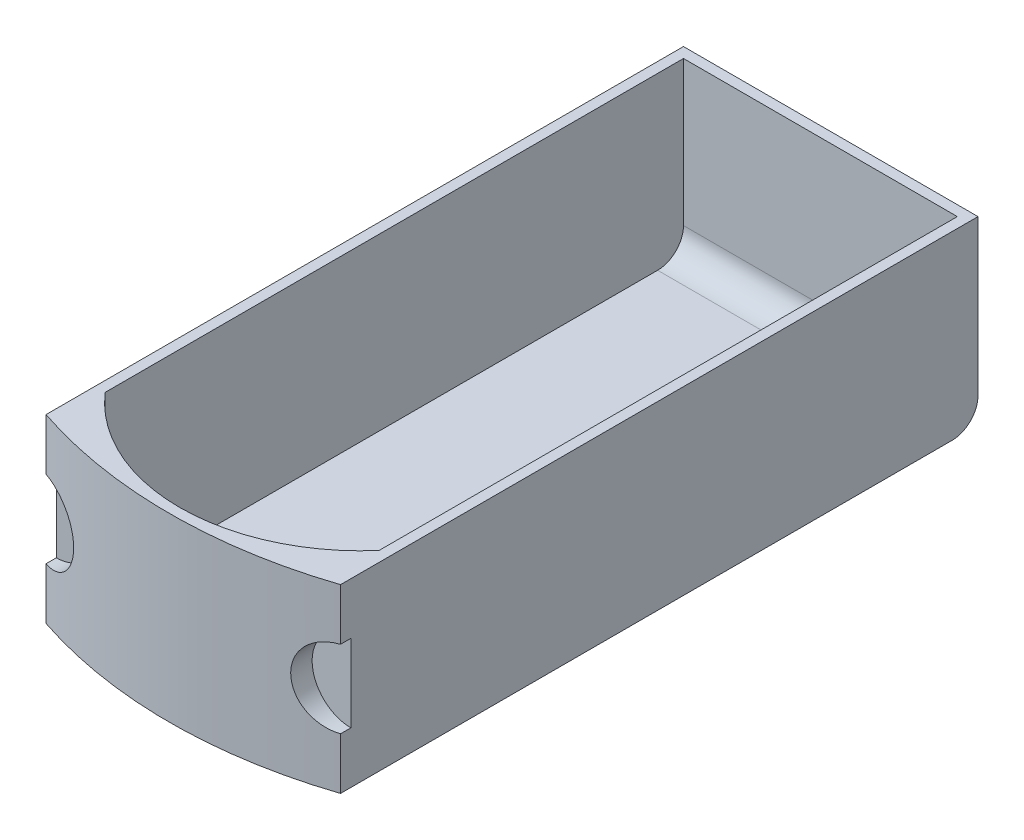
ISO-10303-21;
HEADER;
FILE_DESCRIPTION(('STEP AP214'),'2;1');
FILE_NAME('part.step','',(''),(''),'','','');
FILE_SCHEMA(('AUTOMOTIVE_DESIGN { 1 0 10303 214 1 1 1 1 }'));
ENDSEC;
DATA;
#1=APPLICATION_CONTEXT('core data for automotive mechanical design processes');
#2=APPLICATION_PROTOCOL_DEFINITION('international standard','automotive_design',2000,#1);
#3=PRODUCT_CONTEXT('',#1,'mechanical');
#4=PRODUCT('Part','Part','',(#3));
#5=PRODUCT_RELATED_PRODUCT_CATEGORY('part','',(#4));
#6=PRODUCT_DEFINITION_FORMATION('','',#4);
#7=PRODUCT_DEFINITION_CONTEXT('part definition',#1,'design');
#8=PRODUCT_DEFINITION('design','',#6,#7);
#9=PRODUCT_DEFINITION_SHAPE('','',#8);
#10=(LENGTH_UNIT() NAMED_UNIT(*) SI_UNIT(.MILLI.,.METRE.));
#11=(NAMED_UNIT(*) PLANE_ANGLE_UNIT() SI_UNIT($,.RADIAN.));
#12=(NAMED_UNIT(*) SI_UNIT($,.STERADIAN.) SOLID_ANGLE_UNIT());
#13=UNCERTAINTY_MEASURE_WITH_UNIT(LENGTH_MEASURE(1.E-05),#10,'distance_accuracy_value','');
#14=(GEOMETRIC_REPRESENTATION_CONTEXT(3) GLOBAL_UNCERTAINTY_ASSIGNED_CONTEXT((#13)) GLOBAL_UNIT_ASSIGNED_CONTEXT((#10,
#11,#12)) REPRESENTATION_CONTEXT('',''));
#15=CARTESIAN_POINT('',(0.,0.,0.));
#16=DIRECTION('',(0.,0.,1.));
#17=DIRECTION('',(1.,0.,0.));
#18=AXIS2_PLACEMENT_3D('',#15,#16,#17);
#19=CARTESIAN_POINT('',(0.,2.,-4.72189390365862E-06));
#20=DIRECTION('',(0.,1.,0.));
#21=DIRECTION('',(0.,0.,1.));
#22=AXIS2_PLACEMENT_3D('',#19,#20,#21);
#23=PLANE('',#22);
#24=DIRECTION('',(0.,0.,-1.));
#25=VECTOR('',#24,1.);
#26=CARTESIAN_POINT('',(26.5,2.,-38.));
#27=LINE('',#26,#25);
#28=CARTESIAN_POINT('',(26.5,2.,75.9151357026847));
#29=VERTEX_POINT('',#28);
#30=CARTESIAN_POINT('',(26.5,2.,-31.));
#31=VERTEX_POINT('',#30);
#32=EDGE_CURVE('E178',#29,#31,#27,.T.);
#33=ORIENTED_EDGE('',*,*,#32,.T.);
#34=DIRECTION('',(-1.,0.,0.));
#35=VECTOR('',#34,1.);
#36=CARTESIAN_POINT('',(-26.5,2.,-31.));
#37=LINE('',#36,#35);
#38=CARTESIAN_POINT('',(-26.5,2.,-31.));
#39=VERTEX_POINT('',#38);
#40=EDGE_CURVE('E316',#31,#39,#37,.T.);
#41=ORIENTED_EDGE('',*,*,#40,.T.);
#42=DIRECTION('',(0.,0.,1.));
#43=VECTOR('',#42,1.);
#44=CARTESIAN_POINT('',(-26.5,2.,85.3683196507932));
#45=LINE('',#44,#43);
#46=CARTESIAN_POINT('',(-26.5,2.,75.9151357026848));
#47=VERTEX_POINT('',#46);
#48=EDGE_CURVE('E321',#39,#47,#45,.T.);
#49=ORIENTED_EDGE('',*,*,#48,.T.);
#50=CARTESIAN_POINT('',(0.,2.,52.9026277303528));
#51=DIRECTION('',(0.,1.,0.));
#52=DIRECTION('',(0.,0.,1.));
#53=AXIS2_PLACEMENT_3D('',#50,#51,#52);
#54=CIRCLE('',#53,35.0973720266439);
#55=EDGE_CURVE('E159',#29,#47,#54,.F.);
#56=ORIENTED_EDGE('',*,*,#55,.F.);
#57=EDGE_LOOP('',(#33,#41,#49,#56));
#58=FACE_BOUND('',#57,.T.);
#59=ADVANCED_FACE('F52',(#58),#23,.T.);
#60=CARTESIAN_POINT('',(28.5000000000001,17.5,83.3683196507932));
#61=DIRECTION('',(0.,0.,1.));
#62=DIRECTION('',(1.,0.,0.));
#63=AXIS2_PLACEMENT_3D('',#60,#61,#62);
#64=CYLINDRICAL_SURFACE('',#63,7.5);
#65=CARTESIAN_POINT('',(28.5,25.,85.3683196507932));
#66=CARTESIAN_POINT('',(28.284955635719,25.0000178156559,85.440120490349));
#67=CARTESIAN_POINT('',(28.0696230329358,24.9907515376372,85.5110970737752));
#68=CARTESIAN_POINT('',(27.6398512269584,24.9536301255267,85.6509736940313));
#69=CARTESIAN_POINT('',(27.4254121726603,24.9257720089623,85.7198733958373));
#70=CARTESIAN_POINT('',(26.9987267653422,24.8514043074017,85.8552211992881));
#71=CARTESIAN_POINT('',(26.7864831589949,24.8048737158212,85.9216664474158));
#72=CARTESIAN_POINT('',(26.3660148747222,24.6932892236903,86.0516219709393));
#73=CARTESIAN_POINT('',(26.1577899375169,24.62823652246,86.1151324360551));
#74=CARTESIAN_POINT('',(25.7466161953454,24.4797372250078,86.2389583004088));
#75=CARTESIAN_POINT('',(25.5436762668471,24.3962616664144,86.2992684812413));
#76=CARTESIAN_POINT('',(25.1450456118696,24.2113747365744,86.4162590110142));
#77=CARTESIAN_POINT('',(24.9493547953608,24.1099635881675,86.4729394050406));
#78=CARTESIAN_POINT('',(24.5670028690307,23.8898478498481,86.5823415888424));
#79=CARTESIAN_POINT('',(24.3803347500338,23.7711569807181,86.6350664695816));
#80=CARTESIAN_POINT('',(24.0174795172041,23.5171464261572,86.7363600239144));
#81=CARTESIAN_POINT('',(23.8412919874206,23.3818274013146,86.7849288624854));
#82=CARTESIAN_POINT('',(23.5066506656421,23.1002387854485,86.8761557395615));
#83=CARTESIAN_POINT('',(23.347801184154,22.9544856666986,86.9189569862298));
#84=CARTESIAN_POINT('',(23.042722998827,22.6492411728811,87.0003323577706));
#85=CARTESIAN_POINT('',(22.8964937922624,22.4897503455581,87.0389066510394));
#86=CARTESIAN_POINT('',(22.6179181014163,22.1581129335765,87.1117127725721));
#87=CARTESIAN_POINT('',(22.4855733800918,21.9859647464815,87.1459440495047));
#88=CARTESIAN_POINT('',(22.2359755237589,21.6302779775636,87.2099649277441));
#89=CARTESIAN_POINT('',(22.1187219865728,21.4467396994782,87.239754647421));
#90=CARTESIAN_POINT('',(21.9044318183087,21.0766590048968,87.2938005057676));
#91=CARTESIAN_POINT('',(21.8068059186725,20.8904815477037,87.3182211135352));
#92=CARTESIAN_POINT('',(21.6273683251202,20.510172446416,87.3628380579423));
#93=CARTESIAN_POINT('',(21.5455560909974,20.3160410743077,87.3830345388831));
#94=CARTESIAN_POINT('',(21.3984643522183,19.9212710894434,87.4191709156491));
#95=CARTESIAN_POINT('',(21.3331816816071,19.7206337311148,87.4351116266261));
#96=CARTESIAN_POINT('',(21.2196965391574,19.3142977795769,87.4627227697312));
#97=CARTESIAN_POINT('',(21.171493889748,19.1085992390094,87.4743932462545));
#98=CARTESIAN_POINT('',(21.0934673948599,18.698295131675,87.4932408136181));
#99=CARTESIAN_POINT('',(21.0632586755828,18.4937669849372,87.5005120578527));
#100=CARTESIAN_POINT('',(21.0198171358319,18.0827395187372,87.510957993445));
#101=CARTESIAN_POINT('',(21.0065901133004,17.8762395502791,87.5141312856696));
#102=CARTESIAN_POINT('',(20.9972436815232,17.4628756933658,87.5163742434638));
#103=CARTESIAN_POINT('',(21.0011205721259,17.2560118932981,87.5154447965939));
#104=CARTESIAN_POINT('',(21.0259411187938,16.843366991878,87.5094848695675));
#105=CARTESIAN_POINT('',(21.0468850073573,16.6375859053134,87.5044543335432));
#106=CARTESIAN_POINT('',(21.1054357701054,16.2301795268115,87.4903506543467));
#107=CARTESIAN_POINT('',(21.1429123079301,16.0285343905916,87.4813091290402));
#108=CARTESIAN_POINT('',(21.2341868988921,15.6291950648714,87.4591989970532));
#109=CARTESIAN_POINT('',(21.287985192964,15.4315009337401,87.4461303309258));
#110=CARTESIAN_POINT('',(21.4114492765452,15.0414884069458,87.4159816840087));
#111=CARTESIAN_POINT('',(21.4811120488393,14.8491689968801,87.3989024659541));
#112=CARTESIAN_POINT('',(21.6357671967196,14.4711339933874,87.360745760235));
#113=CARTESIAN_POINT('',(21.720764608093,14.2854205933836,87.3396669590177));
#114=CARTESIAN_POINT('',(21.9058170803067,13.9210763653684,87.2934378542997));
#115=CARTESIAN_POINT('',(22.005940724019,13.7424827357286,87.268268964712));
#116=CARTESIAN_POINT('',(22.220141554745,13.3945009186737,87.2139753340567));
#117=CARTESIAN_POINT('',(22.3342189913471,13.2251128959957,87.1848505222295));
#118=CARTESIAN_POINT('',(22.5754305102391,12.8966313729104,87.1227032856519));
#119=CARTESIAN_POINT('',(22.7025663066293,12.7375392284666,87.0896803491308));
#120=CARTESIAN_POINT('',(22.9688422473281,12.4307256321307,87.0198322485438));
#121=CARTESIAN_POINT('',(23.1079788730314,12.2830008712312,86.9830081983336));
#122=CARTESIAN_POINT('',(23.3998227693561,11.9972142956137,86.904956692507));
#123=CARTESIAN_POINT('',(23.5527292466329,11.8593743035463,86.8636619010806));
#124=CARTESIAN_POINT('',(23.8687092766748,11.5971790691593,86.7773675635137));
#125=CARTESIAN_POINT('',(24.0317827050816,11.4728236619522,86.7323680626857));
#126=CARTESIAN_POINT('',(24.3669195947711,11.238251328964,86.6388105280606));
#127=CARTESIAN_POINT('',(24.5389861914466,11.1280393810819,86.5902512507696));
#128=CARTESIAN_POINT('',(24.8907898595469,10.922377252568,86.4897799350656));
#129=CARTESIAN_POINT('',(25.0705271116448,10.8269274198854,86.4378678176655));
#130=CARTESIAN_POINT('',(25.4423813249212,10.6483660360271,86.3291605219923));
#131=CARTESIAN_POINT('',(25.6347109333401,10.565760671236,86.2722611238744));
#132=CARTESIAN_POINT('',(26.0247086892774,10.41717111761,86.1554174324424));
#133=CARTESIAN_POINT('',(26.2223751540749,10.3511817559435,86.0954740937571));
#134=CARTESIAN_POINT('',(26.6215690083327,10.236073886838,85.9728772679194));
#135=CARTESIAN_POINT('',(26.8230936395389,10.1869437694926,85.9102256793809));
#136=CARTESIAN_POINT('',(27.228705345441,10.1056393673341,85.7825319094099));
#137=CARTESIAN_POINT('',(27.4327913427728,10.0734581830144,85.7174907122825));
#138=CARTESIAN_POINT('',(27.7810528914609,10.033139519682,85.6051158430111));
#139=CARTESIAN_POINT('',(27.9249113452336,10.0206911775878,85.5582971953279));
#140=CARTESIAN_POINT('',(28.2125506621059,10.0041284138106,85.463880763646));
#141=CARTESIAN_POINT('',(28.3563311585055,9.99999829491782,85.4162846183674));
#142=CARTESIAN_POINT('',(28.5,10.,85.3683196507932));
#143=B_SPLINE_CURVE_WITH_KNOTS('',3,(#65,#66,#67,#68,#69,#70,#71,#72,#73,#74,#75,#76,#77,#78,
#79,#80,#81,#82,#83,#84,#85,#86,#87,#88,#89,#90,#91,#92,#93,#94,#95,#96,#97,#98,#99,#100,#101,
#102,#103,#104,#105,#106,#107,#108,#109,#110,#111,#112,#113,#114,#115,#116,#117,#118,#119,#120,
#121,#122,#123,#124,#125,#126,#127,#128,#129,#130,#131,#132,#133,#134,#135,#136,#137,#138,#139,
#140,#141,#142),.UNSPECIFIED.,.F.,.F.,(4,2,2,2,2,2,2,2,2,2,2,2,2,2,2,2,2,2,2,2,2,2,2,2,2,2,2,2,
2,2,2,2,2,2,2,2,2,2,4),(0.,0.679971167171061,1.36005144044534,2.04089896039806,2.7217024050009,
3.4035838553167,4.08545683423296,4.76679130254218,5.448098712164,6.10665840055845,
6.76519184325997,7.42380880108894,8.0824082032391,8.71653864878288,9.35064742812885,
9.98463466276656,10.6186153060199,11.238497349199,11.8585909781463,12.4785504665687,
13.0985184006474,13.7136837627805,14.3288582061522,14.9439157489937,15.5591756412619,
16.1773138592641,16.7954631353886,17.4136936565736,18.031743526719,18.6609194000212,
19.2900875789907,19.9194765947233,20.5488804431605,21.1988881850486,21.8486933180795,
22.498050068737,23.1471422770262,23.6023145344124,24.0566270343598),.UNSPECIFIED.);
#144=CARTESIAN_POINT('',(28.5,25.,85.3683196507932));
#145=VERTEX_POINT('',#144);
#146=CARTESIAN_POINT('',(28.5,10.,85.3683196507932));
#147=VERTEX_POINT('',#146);
#148=EDGE_CURVE('E181',#145,#147,#143,.T.);
#149=ORIENTED_EDGE('',*,*,#148,.T.);
#150=DIRECTION('',(0.,0.,1.));
#151=VECTOR('',#150,1.);
#152=CARTESIAN_POINT('',(28.5,10.,83.3683196507932));
#153=LINE('',#152,#151);
#154=CARTESIAN_POINT('',(28.5,10.,83.3683196507932));
#155=VERTEX_POINT('',#154);
#156=EDGE_CURVE('E304',#147,#155,#153,.F.);
#157=ORIENTED_EDGE('',*,*,#156,.T.);
#158=CARTESIAN_POINT('',(28.5000000000001,17.5,83.3683196507932));
#159=DIRECTION('',(0.,0.,-1.));
#160=DIRECTION('',(-1.,0.,0.));
#161=AXIS2_PLACEMENT_3D('',#158,#159,#160);
#162=CIRCLE('',#161,7.5);
#163=CARTESIAN_POINT('',(28.5,25.,83.3683196507932));
#164=VERTEX_POINT('',#163);
#165=EDGE_CURVE('E188',#155,#164,#162,.T.);
#166=ORIENTED_EDGE('',*,*,#165,.T.);
#167=DIRECTION('',(0.,0.,1.));
#168=VECTOR('',#167,1.);
#169=CARTESIAN_POINT('',(28.5,25.,83.3683196507932));
#170=LINE('',#169,#168);
#171=EDGE_CURVE('E302',#164,#145,#170,.T.);
#172=ORIENTED_EDGE('',*,*,#171,.T.);
#173=EDGE_LOOP('',(#149,#157,#166,#172));
#174=FACE_BOUND('',#173,.T.);
#175=ADVANCED_FACE('F196',(#174),#64,.F.);
#176=CARTESIAN_POINT('',(28.5000000000001,17.5,83.3683196507932));
#177=DIRECTION('',(0.,0.,-1.));
#178=DIRECTION('',(-1.,0.,0.));
#179=AXIS2_PLACEMENT_3D('',#176,#177,#178);
#180=PLANE('',#179);
#181=DIRECTION('',(0.,-1.,0.));
#182=VECTOR('',#181,1.);
#183=CARTESIAN_POINT('',(28.5,35.,83.3683196507932));
#184=LINE('',#183,#182);
#185=EDGE_CURVE('E299',#164,#155,#184,.T.);
#186=ORIENTED_EDGE('',*,*,#185,.F.);
#187=ORIENTED_EDGE('',*,*,#165,.F.);
#188=EDGE_LOOP('',(#186,#187));
#189=FACE_BOUND('',#188,.T.);
#190=ADVANCED_FACE('F210',(#189),#180,.F.);
#191=CARTESIAN_POINT('',(26.5,35.,-38.));
#192=DIRECTION('',(-1.,0.,0.));
#193=DIRECTION('',(0.,0.,1.));
#194=AXIS2_PLACEMENT_3D('',#191,#192,#193);
#195=PLANE('',#194);
#196=DIRECTION('',(0.,-1.,0.));
#197=VECTOR('',#196,1.);
#198=CARTESIAN_POINT('',(26.5,35.,-36.));
#199=LINE('',#198,#197);
#200=CARTESIAN_POINT('',(26.5,35.,-36.));
#201=VERTEX_POINT('',#200);
#202=CARTESIAN_POINT('',(26.5,7.,-36.));
#203=VERTEX_POINT('',#202);
#204=EDGE_CURVE('E176',#201,#203,#199,.T.);
#205=ORIENTED_EDGE('',*,*,#204,.T.);
#206=CARTESIAN_POINT('',(26.5,7.,-31.));
#207=DIRECTION('',(-1.,0.,0.));
#208=DIRECTION('',(0.,0.,1.));
#209=AXIS2_PLACEMENT_3D('',#206,#207,#208);
#210=CIRCLE('',#209,5.);
#211=EDGE_CURVE('E12',#203,#31,#210,.T.);
#212=ORIENTED_EDGE('',*,*,#211,.T.);
#213=ORIENTED_EDGE('',*,*,#32,.F.);
#214=DIRECTION('',(0.,1.,0.));
#215=VECTOR('',#214,1.);
#216=CARTESIAN_POINT('',(26.5,-27.1254860768228,75.9151357026847));
#217=LINE('',#216,#215);
#218=CARTESIAN_POINT('',(26.5,35.,75.9151357026847));
#219=VERTEX_POINT('',#218);
#220=EDGE_CURVE('E170',#29,#219,#217,.T.);
#221=ORIENTED_EDGE('',*,*,#220,.T.);
#222=DIRECTION('',(0.,0.,-1.));
#223=VECTOR('',#222,1.);
#224=CARTESIAN_POINT('',(26.5,35.,-38.));
#225=LINE('',#224,#223);
#226=EDGE_CURVE('E169',#219,#201,#225,.T.);
#227=ORIENTED_EDGE('',*,*,#226,.T.);
#228=EDGE_LOOP('',(#205,#212,#213,#221,#227));
#229=FACE_BOUND('',#228,.T.);
#230=ADVANCED_FACE('F206',(#229),#195,.T.);
#231=CARTESIAN_POINT('',(-28.5,17.5,83.3683196507932));
#232=DIRECTION('',(0.,0.,-1.));
#233=DIRECTION('',(-1.,0.,0.));
#234=AXIS2_PLACEMENT_3D('',#231,#232,#233);
#235=PLANE('',#234);
#236=DIRECTION('',(0.,1.,0.));
#237=VECTOR('',#236,1.);
#238=CARTESIAN_POINT('',(-28.5,35.,83.3683196507932));
#239=LINE('',#238,#237);
#240=CARTESIAN_POINT('',(-28.5,10.,83.3683196507932));
#241=VERTEX_POINT('',#240);
#242=CARTESIAN_POINT('',(-28.5,25.,83.3683196507932));
#243=VERTEX_POINT('',#242);
#244=EDGE_CURVE('E296',#241,#243,#239,.T.);
#245=ORIENTED_EDGE('',*,*,#244,.F.);
#246=CARTESIAN_POINT('',(-28.5,17.5,83.3683196507932));
#247=DIRECTION('',(0.,0.,-1.));
#248=DIRECTION('',(-1.,0.,0.));
#249=AXIS2_PLACEMENT_3D('',#246,#247,#248);
#250=CIRCLE('',#249,7.49999999999999);
#251=EDGE_CURVE('E259',#243,#241,#250,.T.);
#252=ORIENTED_EDGE('',*,*,#251,.F.);
#253=EDGE_LOOP('',(#245,#252));
#254=FACE_BOUND('',#253,.T.);
#255=ADVANCED_FACE('F209',(#254),#235,.F.);
#256=CARTESIAN_POINT('',(-28.5,17.5,83.3683196507932));
#257=DIRECTION('',(0.,0.,1.));
#258=DIRECTION('',(1.,0.,0.));
#259=AXIS2_PLACEMENT_3D('',#256,#257,#258);
#260=CYLINDRICAL_SURFACE('',#259,7.49999999999999);
#261=CARTESIAN_POINT('',(-28.5,10.,85.3683196507932));
#262=CARTESIAN_POINT('',(-28.284955635719,9.99998218434414,85.4401204903489));
#263=CARTESIAN_POINT('',(-28.0696230329358,10.0092484623628,85.5110970737752));
#264=CARTESIAN_POINT('',(-27.6398512269584,10.0463698744733,85.6509736940313));
#265=CARTESIAN_POINT('',(-27.4254121726604,10.0742279910377,85.7198733958373));
#266=CARTESIAN_POINT('',(-26.9987267653422,10.1485956925983,85.8552211992881));
#267=CARTESIAN_POINT('',(-26.7864831589949,10.1951262841788,85.9216664474158));
#268=CARTESIAN_POINT('',(-26.3660148747222,10.3067107763097,86.0516219709393));
#269=CARTESIAN_POINT('',(-26.1577899375169,10.37176347754,86.1151324360551));
#270=CARTESIAN_POINT('',(-25.7466161953454,10.5202627749922,86.2389583004088));
#271=CARTESIAN_POINT('',(-25.5436762668471,10.6037383335855,86.2992684812413));
#272=CARTESIAN_POINT('',(-25.1450456118696,10.7886252634255,86.4162590110142));
#273=CARTESIAN_POINT('',(-24.9493547953608,10.8900364118325,86.4729394050406));
#274=CARTESIAN_POINT('',(-24.5670028690307,11.1101521501519,86.5823415888424));
#275=CARTESIAN_POINT('',(-24.3803347500338,11.2288430192819,86.6350664695816));
#276=CARTESIAN_POINT('',(-24.0174795172041,11.4828535738427,86.7363600239144));
#277=CARTESIAN_POINT('',(-23.8412919874206,11.6181725986854,86.7849288624854));
#278=CARTESIAN_POINT('',(-23.5066506656421,11.8997612145514,86.8761557395615));
#279=CARTESIAN_POINT('',(-23.347801184154,12.0455143333013,86.9189569862298));
#280=CARTESIAN_POINT('',(-23.042722998827,12.3507588271189,87.0003323577706));
#281=CARTESIAN_POINT('',(-22.8964937922624,12.5102496544419,87.0389066510394));
#282=CARTESIAN_POINT('',(-22.6179181014163,12.8418870664234,87.1117127725721));
#283=CARTESIAN_POINT('',(-22.4855733800918,13.0140352535184,87.1459440495047));
#284=CARTESIAN_POINT('',(-22.2359755237589,13.3697220224363,87.2099649277441));
#285=CARTESIAN_POINT('',(-22.1187219865727,13.5532603005217,87.239754647421));
#286=CARTESIAN_POINT('',(-21.9044318183087,13.9233409951031,87.2938005057676));
#287=CARTESIAN_POINT('',(-21.8068059186725,14.1095184522962,87.3182211135352));
#288=CARTESIAN_POINT('',(-21.6273683251201,14.4898275535839,87.3628380579423));
#289=CARTESIAN_POINT('',(-21.5455560909974,14.6839589256922,87.3830345388831));
#290=CARTESIAN_POINT('',(-21.3984643522183,15.0787289105565,87.4191709156491));
#291=CARTESIAN_POINT('',(-21.333181681607,15.2793662688851,87.4351116266261));
#292=CARTESIAN_POINT('',(-21.2196965391573,15.685702220423,87.4627227697313));
#293=CARTESIAN_POINT('',(-21.1714938897479,15.8914007609905,87.4743932462545));
#294=CARTESIAN_POINT('',(-21.0934673948598,16.3017048683249,87.4932408136181));
#295=CARTESIAN_POINT('',(-21.0632586755827,16.5062330150627,87.5005120578528));
#296=CARTESIAN_POINT('',(-21.0198171358318,16.9172604812627,87.510957993445));
#297=CARTESIAN_POINT('',(-21.0065901133003,17.1237604497208,87.5141312856696));
#298=CARTESIAN_POINT('',(-20.9972436815231,17.5371243066341,87.5163742434639));
#299=CARTESIAN_POINT('',(-21.0011205721258,17.7439881067018,87.5154447965939));
#300=CARTESIAN_POINT('',(-21.0259411187937,18.1566330081219,87.5094848695676));
#301=CARTESIAN_POINT('',(-21.0468850073572,18.3624140946865,87.5044543335433));
#302=CARTESIAN_POINT('',(-21.1054357701053,18.7698204731884,87.4903506543467));
#303=CARTESIAN_POINT('',(-21.14291230793,18.9714656094083,87.4813091290403));
#304=CARTESIAN_POINT('',(-21.234186898892,19.3708049351285,87.4591989970533));
#305=CARTESIAN_POINT('',(-21.2879851929639,19.5684990662598,87.4461303309258));
#306=CARTESIAN_POINT('',(-21.4114492765451,19.9585115930541,87.4159816840087));
#307=CARTESIAN_POINT('',(-21.4811120488392,20.1508310031198,87.3989024659541));
#308=CARTESIAN_POINT('',(-21.6357671967195,20.5288660066125,87.360745760235));
#309=CARTESIAN_POINT('',(-21.7207646080929,20.7145794066163,87.3396669590177));
#310=CARTESIAN_POINT('',(-21.9058170803065,21.0789236346315,87.2934378542998));
#311=CARTESIAN_POINT('',(-22.0059407240189,21.2575172642713,87.268268964712));
#312=CARTESIAN_POINT('',(-22.2201415547448,21.6054990813262,87.2139753340567));
#313=CARTESIAN_POINT('',(-22.3342189913469,21.7748871040043,87.1848505222295));
#314=CARTESIAN_POINT('',(-22.575430510239,22.1033686270895,87.122703285652));
#315=CARTESIAN_POINT('',(-22.7025663066292,22.2624607715333,87.0896803491308));
#316=CARTESIAN_POINT('',(-22.9688422473279,22.5692743678692,87.0198322485438));
#317=CARTESIAN_POINT('',(-23.1079788730313,22.7169991287688,86.9830081983336));
#318=CARTESIAN_POINT('',(-23.3998227693559,23.0027857043863,86.904956692507));
#319=CARTESIAN_POINT('',(-23.5527292466327,23.1406256964536,86.8636619010807));
#320=CARTESIAN_POINT('',(-23.8687092766747,23.4028209308406,86.7773675635138));
#321=CARTESIAN_POINT('',(-24.0317827050815,23.5271763380477,86.7323680626858));
#322=CARTESIAN_POINT('',(-24.3669195947709,23.7617486710359,86.6388105280607));
#323=CARTESIAN_POINT('',(-24.5389861914465,23.871960618918,86.5902512507697));
#324=CARTESIAN_POINT('',(-24.8907898595467,24.077622747432,86.4897799350656));
#325=CARTESIAN_POINT('',(-25.0705271116446,24.1730725801146,86.4378678176656));
#326=CARTESIAN_POINT('',(-25.442381324921,24.3516339639729,86.3291605219923));
#327=CARTESIAN_POINT('',(-25.6347109333399,24.434239328764,86.2722611238745));
#328=CARTESIAN_POINT('',(-26.0247086892772,24.5828288823899,86.1554174324424));
#329=CARTESIAN_POINT('',(-26.2223751540747,24.6488182440565,86.0954740937571));
#330=CARTESIAN_POINT('',(-26.6215690083325,24.7639261131619,85.9728772679195));
#331=CARTESIAN_POINT('',(-26.8230936395387,24.8130562305074,85.910225679381));
#332=CARTESIAN_POINT('',(-27.2287053454408,24.8943606326659,85.78253190941));
#333=CARTESIAN_POINT('',(-27.4327913427726,24.9265418169856,85.7174907122826));
#334=CARTESIAN_POINT('',(-27.7810528914607,24.966860480318,85.6051158430112));
#335=CARTESIAN_POINT('',(-27.9249113452334,24.9793088224122,85.558297195328));
#336=CARTESIAN_POINT('',(-28.2125506621058,24.9958715861894,85.463880763646));
#337=CARTESIAN_POINT('',(-28.3563311585055,25.0000017050822,85.4162846183674));
#338=CARTESIAN_POINT('',(-28.5,25.,85.3683196507932));
#339=B_SPLINE_CURVE_WITH_KNOTS('',3,(#261,#262,#263,#264,#265,#266,#267,#268,#269,#270,#271,
#272,#273,#274,#275,#276,#277,#278,#279,#280,#281,#282,#283,#284,#285,#286,#287,#288,#289,#290,
#291,#292,#293,#294,#295,#296,#297,#298,#299,#300,#301,#302,#303,#304,#305,#306,#307,#308,#309,
#310,#311,#312,#313,#314,#315,#316,#317,#318,#319,#320,#321,#322,#323,#324,#325,#326,#327,#328,
#329,#330,#331,#332,#333,#334,#335,#336,#337,#338),.UNSPECIFIED.,.F.,.F.,(4,2,2,2,2,2,2,2,2,2,2,
2,2,2,2,2,2,2,2,2,2,2,2,2,2,2,2,2,2,2,2,2,2,2,2,2,2,2,4),(0.,0.67997116717105,1.36005144044533,
2.04089896039805,2.7217024050009,3.40358385531669,4.08545683423295,4.76679130254216,
5.44809871216399,6.10665840055845,6.76519184325996,7.42380880108894,8.08240820323909,
8.71653864878287,9.35064742812884,9.98463466276655,10.6186153060199,11.238497349199,
11.8585909781463,12.4785504665687,13.0985184006474,13.7136837627805,14.3288582061522,
14.9439157489937,15.5591756412618,16.1773138592641,16.7954631353886,17.4136936565736,
18.031743526719,18.6609194000211,19.2900875789906,19.9194765947233,20.5488804431605,
21.1988881850485,21.8486933180795,22.498050068737,23.1471422770261,23.6023145344125,
24.0566270343599),.UNSPECIFIED.);
#340=CARTESIAN_POINT('',(-28.5,10.,85.3683196507932));
#341=VERTEX_POINT('',#340);
#342=CARTESIAN_POINT('',(-28.5,25.,85.3683196507932));
#343=VERTEX_POINT('',#342);
#344=EDGE_CURVE('E254',#341,#343,#339,.T.);
#345=ORIENTED_EDGE('',*,*,#344,.T.);
#346=DIRECTION('',(0.,0.,1.));
#347=VECTOR('',#346,1.);
#348=CARTESIAN_POINT('',(-28.5,25.,83.3683196507932));
#349=LINE('',#348,#347);
#350=EDGE_CURVE('E263',#343,#243,#349,.F.);
#351=ORIENTED_EDGE('',*,*,#350,.T.);
#352=ORIENTED_EDGE('',*,*,#251,.T.);
#353=DIRECTION('',(0.,0.,1.));
#354=VECTOR('',#353,1.);
#355=CARTESIAN_POINT('',(-28.5,10.,83.3683196507932));
#356=LINE('',#355,#354);
#357=EDGE_CURVE('E261',#241,#341,#356,.T.);
#358=ORIENTED_EDGE('',*,*,#357,.T.);
#359=EDGE_LOOP('',(#345,#351,#352,#358));
#360=FACE_BOUND('',#359,.T.);
#361=ADVANCED_FACE('F205',(#360),#260,.F.);
#362=CARTESIAN_POINT('',(-26.5,35.,85.3683196507932));
#363=DIRECTION('',(1.,0.,0.));
#364=DIRECTION('',(0.,0.,-1.));
#365=AXIS2_PLACEMENT_3D('',#362,#363,#364);
#366=PLANE('',#365);
#367=ORIENTED_EDGE('',*,*,#48,.F.);
#368=CARTESIAN_POINT('',(-26.5,7.,-31.));
#369=DIRECTION('',(1.,0.,0.));
#370=DIRECTION('',(0.,0.,-1.));
#371=AXIS2_PLACEMENT_3D('',#368,#369,#370);
#372=CIRCLE('',#371,5.);
#373=CARTESIAN_POINT('',(-26.5,7.,-36.));
#374=VERTEX_POINT('',#373);
#375=EDGE_CURVE('E74',#39,#374,#372,.T.);
#376=ORIENTED_EDGE('',*,*,#375,.T.);
#377=DIRECTION('',(0.,-1.,0.));
#378=VECTOR('',#377,1.);
#379=CARTESIAN_POINT('',(-26.5,35.,-36.));
#380=LINE('',#379,#378);
#381=CARTESIAN_POINT('',(-26.5,35.,-36.));
#382=VERTEX_POINT('',#381);
#383=EDGE_CURVE('E173',#382,#374,#380,.T.);
#384=ORIENTED_EDGE('',*,*,#383,.F.);
#385=DIRECTION('',(0.,0.,1.));
#386=VECTOR('',#385,1.);
#387=CARTESIAN_POINT('',(-26.5,35.,85.3683196507932));
#388=LINE('',#387,#386);
#389=CARTESIAN_POINT('',(-26.5,35.,75.9151357026848));
#390=VERTEX_POINT('',#389);
#391=EDGE_CURVE('E168',#382,#390,#388,.T.);
#392=ORIENTED_EDGE('',*,*,#391,.T.);
#393=DIRECTION('',(0.,1.,0.));
#394=VECTOR('',#393,1.);
#395=CARTESIAN_POINT('',(-26.5,-27.1254860768228,75.9151357026848));
#396=LINE('',#395,#394);
#397=EDGE_CURVE('E153',#47,#390,#396,.T.);
#398=ORIENTED_EDGE('',*,*,#397,.F.);
#399=EDGE_LOOP('',(#367,#376,#384,#392,#398));
#400=FACE_BOUND('',#399,.T.);
#401=ADVANCED_FACE('F172',(#400),#366,.T.);
#402=CARTESIAN_POINT('',(0.,35.,-4.72189390365862E-06));
#403=DIRECTION('',(0.,-1.,0.));
#404=DIRECTION('',(0.,0.,-1.));
#405=AXIS2_PLACEMENT_3D('',#402,#403,#404);
#406=CYLINDRICAL_SURFACE('',#405,90.0000044788905);
#407=ORIENTED_EDGE('',*,*,#148,.F.);
#408=DIRECTION('',(0.,-1.,0.));
#409=VECTOR('',#408,1.);
#410=CARTESIAN_POINT('',(28.5,35.,85.3683196507932));
#411=LINE('',#410,#409);
#412=CARTESIAN_POINT('',(28.5,35.,85.3683196507932));
#413=VERTEX_POINT('',#412);
#414=EDGE_CURVE('E286',#413,#145,#411,.T.);
#415=ORIENTED_EDGE('',*,*,#414,.F.);
#416=CARTESIAN_POINT('',(0.,35.,-4.72189390365862E-06));
#417=DIRECTION('',(0.,1.,0.));
#418=DIRECTION('',(0.,0.,1.));
#419=AXIS2_PLACEMENT_3D('',#416,#417,#418);
#420=CIRCLE('',#419,90.0000044788905);
#421=CARTESIAN_POINT('',(-28.5,35.,85.3683196507932));
#422=VERTEX_POINT('',#421);
#423=EDGE_CURVE('E272',#422,#413,#420,.T.);
#424=ORIENTED_EDGE('',*,*,#423,.F.);
#425=DIRECTION('',(0.,-1.,0.));
#426=VECTOR('',#425,1.);
#427=CARTESIAN_POINT('',(-28.5,35.,85.3683196507932));
#428=LINE('',#427,#426);
#429=EDGE_CURVE('E290',#422,#343,#428,.T.);
#430=ORIENTED_EDGE('',*,*,#429,.T.);
#431=ORIENTED_EDGE('',*,*,#344,.F.);
#432=CARTESIAN_POINT('',(-28.5,0.,85.3683196507932));
#433=VERTEX_POINT('',#432);
#434=EDGE_CURVE('E289',#341,#433,#428,.T.);
#435=ORIENTED_EDGE('',*,*,#434,.T.);
#436=CARTESIAN_POINT('',(0.,0.,-4.72189390365862E-06));
#437=DIRECTION('',(0.,1.,0.));
#438=DIRECTION('',(0.,0.,1.));
#439=AXIS2_PLACEMENT_3D('',#436,#437,#438);
#440=CIRCLE('',#439,90.0000044788905);
#441=CARTESIAN_POINT('',(28.5,0.,85.3683196507932));
#442=VERTEX_POINT('',#441);
#443=EDGE_CURVE('E278',#433,#442,#440,.T.);
#444=ORIENTED_EDGE('',*,*,#443,.T.);
#445=EDGE_CURVE('E285',#147,#442,#411,.T.);
#446=ORIENTED_EDGE('',*,*,#445,.F.);
#447=EDGE_LOOP('',(#407,#415,#424,#430,#431,#435,#444,#446));
#448=FACE_BOUND('',#447,.T.);
#449=ADVANCED_FACE('F204',(#448),#406,.T.);
#450=CARTESIAN_POINT('',(28.5,35.,-38.));
#451=DIRECTION('',(-1.,0.,0.));
#452=DIRECTION('',(0.,0.,1.));
#453=AXIS2_PLACEMENT_3D('',#450,#451,#452);
#454=PLANE('',#453);
#455=DIRECTION('',(0.,0.,-1.));
#456=VECTOR('',#455,1.);
#457=CARTESIAN_POINT('',(28.5,0.,-38.));
#458=LINE('',#457,#456);
#459=CARTESIAN_POINT('',(28.5,0.,-33.));
#460=VERTEX_POINT('',#459);
#461=EDGE_CURVE('E270',#442,#460,#458,.T.);
#462=ORIENTED_EDGE('',*,*,#461,.T.);
#463=CARTESIAN_POINT('',(28.5,5.,-33.));
#464=DIRECTION('',(-1.,0.,0.));
#465=DIRECTION('',(0.,0.,1.));
#466=AXIS2_PLACEMENT_3D('',#463,#464,#465);
#467=CIRCLE('',#466,5.);
#468=CARTESIAN_POINT('',(28.5,5.,-38.));
#469=VERTEX_POINT('',#468);
#470=EDGE_CURVE('E314',#460,#469,#467,.F.);
#471=ORIENTED_EDGE('',*,*,#470,.T.);
#472=DIRECTION('',(0.,-1.,0.));
#473=VECTOR('',#472,1.);
#474=CARTESIAN_POINT('',(28.5,35.,-38.));
#475=LINE('',#474,#473);
#476=CARTESIAN_POINT('',(28.5,35.,-38.));
#477=VERTEX_POINT('',#476);
#478=EDGE_CURVE('E276',#477,#469,#475,.T.);
#479=ORIENTED_EDGE('',*,*,#478,.F.);
#480=DIRECTION('',(0.,0.,-1.));
#481=VECTOR('',#480,1.);
#482=CARTESIAN_POINT('',(28.5,35.,-38.));
#483=LINE('',#482,#481);
#484=EDGE_CURVE('E274',#413,#477,#483,.T.);
#485=ORIENTED_EDGE('',*,*,#484,.F.);
#486=ORIENTED_EDGE('',*,*,#414,.T.);
#487=ORIENTED_EDGE('',*,*,#171,.F.);
#488=ORIENTED_EDGE('',*,*,#185,.T.);
#489=ORIENTED_EDGE('',*,*,#156,.F.);
#490=ORIENTED_EDGE('',*,*,#445,.T.);
#491=EDGE_LOOP('',(#462,#471,#479,#485,#486,#487,#488,#489,#490));
#492=FACE_BOUND('',#491,.T.);
#493=ADVANCED_FACE('F231',(#492),#454,.F.);
#494=CARTESIAN_POINT('',(-28.5,35.,85.3683196507932));
#495=DIRECTION('',(1.,0.,0.));
#496=DIRECTION('',(0.,0.,-1.));
#497=AXIS2_PLACEMENT_3D('',#494,#495,#496);
#498=PLANE('',#497);
#499=DIRECTION('',(0.,-1.,0.));
#500=VECTOR('',#499,1.);
#501=CARTESIAN_POINT('',(-28.5,35.,-38.));
#502=LINE('',#501,#500);
#503=CARTESIAN_POINT('',(-28.5,35.,-38.));
#504=VERTEX_POINT('',#503);
#505=CARTESIAN_POINT('',(-28.5,5.,-38.));
#506=VERTEX_POINT('',#505);
#507=EDGE_CURVE('E293',#504,#506,#502,.T.);
#508=ORIENTED_EDGE('',*,*,#507,.T.);
#509=CARTESIAN_POINT('',(-28.5,5.,-33.));
#510=DIRECTION('',(1.,0.,0.));
#511=DIRECTION('',(0.,0.,-1.));
#512=AXIS2_PLACEMENT_3D('',#509,#510,#511);
#513=CIRCLE('',#512,5.);
#514=CARTESIAN_POINT('',(-28.5,0.,-33.));
#515=VERTEX_POINT('',#514);
#516=EDGE_CURVE('E310',#506,#515,#513,.F.);
#517=ORIENTED_EDGE('',*,*,#516,.T.);
#518=DIRECTION('',(0.,0.,1.));
#519=VECTOR('',#518,1.);
#520=CARTESIAN_POINT('',(-28.5,0.,85.3683196507932));
#521=LINE('',#520,#519);
#522=EDGE_CURVE('E265',#515,#433,#521,.T.);
#523=ORIENTED_EDGE('',*,*,#522,.T.);
#524=ORIENTED_EDGE('',*,*,#434,.F.);
#525=ORIENTED_EDGE('',*,*,#357,.F.);
#526=ORIENTED_EDGE('',*,*,#244,.T.);
#527=ORIENTED_EDGE('',*,*,#350,.F.);
#528=ORIENTED_EDGE('',*,*,#429,.F.);
#529=DIRECTION('',(0.,0.,1.));
#530=VECTOR('',#529,1.);
#531=CARTESIAN_POINT('',(-28.5,35.,85.3683196507932));
#532=LINE('',#531,#530);
#533=EDGE_CURVE('E269',#504,#422,#532,.T.);
#534=ORIENTED_EDGE('',*,*,#533,.F.);
#535=EDGE_LOOP('',(#508,#517,#523,#524,#525,#526,#527,#528,#534));
#536=FACE_BOUND('',#535,.T.);
#537=ADVANCED_FACE('F227',(#536),#498,.F.);
#538=CARTESIAN_POINT('',(-28.5,35.,-38.));
#539=DIRECTION('',(0.,0.,1.));
#540=DIRECTION('',(1.,0.,0.));
#541=AXIS2_PLACEMENT_3D('',#538,#539,#540);
#542=PLANE('',#541);
#543=ORIENTED_EDGE('',*,*,#478,.T.);
#544=DIRECTION('',(-1.,0.,0.));
#545=VECTOR('',#544,1.);
#546=CARTESIAN_POINT('',(-28.5,5.,-38.));
#547=LINE('',#546,#545);
#548=EDGE_CURVE('E307',#469,#506,#547,.T.);
#549=ORIENTED_EDGE('',*,*,#548,.T.);
#550=ORIENTED_EDGE('',*,*,#507,.F.);
#551=DIRECTION('',(-1.,0.,0.));
#552=VECTOR('',#551,1.);
#553=CARTESIAN_POINT('',(-28.5,35.,-38.));
#554=LINE('',#553,#552);
#555=EDGE_CURVE('E266',#477,#504,#554,.T.);
#556=ORIENTED_EDGE('',*,*,#555,.F.);
#557=EDGE_LOOP('',(#543,#549,#550,#556));
#558=FACE_BOUND('',#557,.T.);
#559=ADVANCED_FACE('F224',(#558),#542,.F.);
#560=CARTESIAN_POINT('',(0.,35.,-4.72189390365862E-06));
#561=DIRECTION('',(0.,1.,0.));
#562=DIRECTION('',(0.,0.,1.));
#563=AXIS2_PLACEMENT_3D('',#560,#561,#562);
#564=PLANE('',#563);
#565=ORIENTED_EDGE('',*,*,#226,.F.);
#566=CARTESIAN_POINT('',(0.,35.,52.9026277303528));
#567=DIRECTION('',(0.,1.,0.));
#568=DIRECTION('',(0.,0.,1.));
#569=AXIS2_PLACEMENT_3D('',#566,#567,#568);
#570=CIRCLE('',#569,35.0973720266439);
#571=EDGE_CURVE('E157',#390,#219,#570,.T.);
#572=ORIENTED_EDGE('',*,*,#571,.F.);
#573=ORIENTED_EDGE('',*,*,#391,.F.);
#574=DIRECTION('',(-1.,0.,0.));
#575=VECTOR('',#574,1.);
#576=CARTESIAN_POINT('',(-28.5,35.,-36.));
#577=LINE('',#576,#575);
#578=EDGE_CURVE('E174',#201,#382,#577,.T.);
#579=ORIENTED_EDGE('',*,*,#578,.F.);
#580=EDGE_LOOP('',(#565,#572,#573,#579));
#581=FACE_BOUND('',#580,.T.);
#582=ORIENTED_EDGE('',*,*,#555,.T.);
#583=ORIENTED_EDGE('',*,*,#533,.T.);
#584=ORIENTED_EDGE('',*,*,#423,.T.);
#585=ORIENTED_EDGE('',*,*,#484,.T.);
#586=EDGE_LOOP('',(#582,#583,#584,#585));
#587=FACE_BOUND('',#586,.T.);
#588=ADVANCED_FACE('F165',(#581,#587),#564,.T.);
#589=CARTESIAN_POINT('',(0.,0.,-4.72189390365862E-06));
#590=DIRECTION('',(0.,1.,0.));
#591=DIRECTION('',(0.,0.,1.));
#592=AXIS2_PLACEMENT_3D('',#589,#590,#591);
#593=PLANE('',#592);
#594=ORIENTED_EDGE('',*,*,#522,.F.);
#595=DIRECTION('',(-1.,0.,0.));
#596=VECTOR('',#595,1.);
#597=CARTESIAN_POINT('',(0.,0.,-33.));
#598=LINE('',#597,#596);
#599=EDGE_CURVE('E312',#515,#460,#598,.F.);
#600=ORIENTED_EDGE('',*,*,#599,.T.);
#601=ORIENTED_EDGE('',*,*,#461,.F.);
#602=ORIENTED_EDGE('',*,*,#443,.F.);
#603=EDGE_LOOP('',(#594,#600,#601,#602));
#604=FACE_BOUND('',#603,.T.);
#605=ADVANCED_FACE('F201',(#604),#593,.F.);
#606=CARTESIAN_POINT('',(-28.5,35.,-36.));
#607=DIRECTION('',(0.,0.,1.));
#608=DIRECTION('',(1.,0.,0.));
#609=AXIS2_PLACEMENT_3D('',#606,#607,#608);
#610=PLANE('',#609);
#611=ORIENTED_EDGE('',*,*,#383,.T.);
#612=DIRECTION('',(-1.,0.,0.));
#613=VECTOR('',#612,1.);
#614=CARTESIAN_POINT('',(26.5,7.,-36.));
#615=LINE('',#614,#613);
#616=EDGE_CURVE('E60',#374,#203,#615,.F.);
#617=ORIENTED_EDGE('',*,*,#616,.T.);
#618=ORIENTED_EDGE('',*,*,#204,.F.);
#619=ORIENTED_EDGE('',*,*,#578,.T.);
#620=EDGE_LOOP('',(#611,#617,#618,#619));
#621=FACE_BOUND('',#620,.T.);
#622=ADVANCED_FACE('F198',(#621),#610,.T.);
#623=CARTESIAN_POINT('',(0.,-27.1254860768228,52.9026277303528));
#624=DIRECTION('',(0.,1.,0.));
#625=DIRECTION('',(0.,0.,1.));
#626=AXIS2_PLACEMENT_3D('',#623,#624,#625);
#627=CYLINDRICAL_SURFACE('',#626,35.0973720266439);
#628=ORIENTED_EDGE('',*,*,#571,.T.);
#629=ORIENTED_EDGE('',*,*,#220,.F.);
#630=ORIENTED_EDGE('',*,*,#55,.T.);
#631=ORIENTED_EDGE('',*,*,#397,.T.);
#632=EDGE_LOOP('',(#628,#629,#630,#631));
#633=FACE_BOUND('',#632,.T.);
#634=ADVANCED_FACE('F155',(#633),#627,.F.);
#635=CARTESIAN_POINT('',(-28.5,5.,-33.));
#636=DIRECTION('',(-1.,0.,0.));
#637=DIRECTION('',(0.,0.,1.));
#638=AXIS2_PLACEMENT_3D('',#635,#636,#637);
#639=CYLINDRICAL_SURFACE('',#638,5.);
#640=ORIENTED_EDGE('',*,*,#470,.F.);
#641=ORIENTED_EDGE('',*,*,#599,.F.);
#642=ORIENTED_EDGE('',*,*,#516,.F.);
#643=ORIENTED_EDGE('',*,*,#548,.F.);
#644=EDGE_LOOP('',(#640,#641,#642,#643));
#645=FACE_BOUND('',#644,.T.);
#646=ADVANCED_FACE('F213',(#645),#639,.T.);
#647=CARTESIAN_POINT('',(0.,7.,-31.));
#648=DIRECTION('',(1.,0.,0.));
#649=DIRECTION('',(0.,0.,-1.));
#650=AXIS2_PLACEMENT_3D('',#647,#648,#649);
#651=CYLINDRICAL_SURFACE('',#650,5.);
#652=ORIENTED_EDGE('',*,*,#211,.F.);
#653=ORIENTED_EDGE('',*,*,#616,.F.);
#654=ORIENTED_EDGE('',*,*,#375,.F.);
#655=ORIENTED_EDGE('',*,*,#40,.F.);
#656=EDGE_LOOP('',(#652,#653,#654,#655));
#657=FACE_BOUND('',#656,.T.);
#658=ADVANCED_FACE('F54',(#657),#651,.F.);
#659=CLOSED_SHELL('',(#59,#175,#190,#230,#255,#361,#401,#449,#493,#537,#559,#588,#605,#622,#634,
#646,#658));
#660=MANIFOLD_SOLID_BREP('B2',#659);
#661=ADVANCED_BREP_SHAPE_REPRESENTATION('',(#18,#660),#14);
#662=SHAPE_DEFINITION_REPRESENTATION(#9,#661);
ENDSEC;
END-ISO-10303-21;
